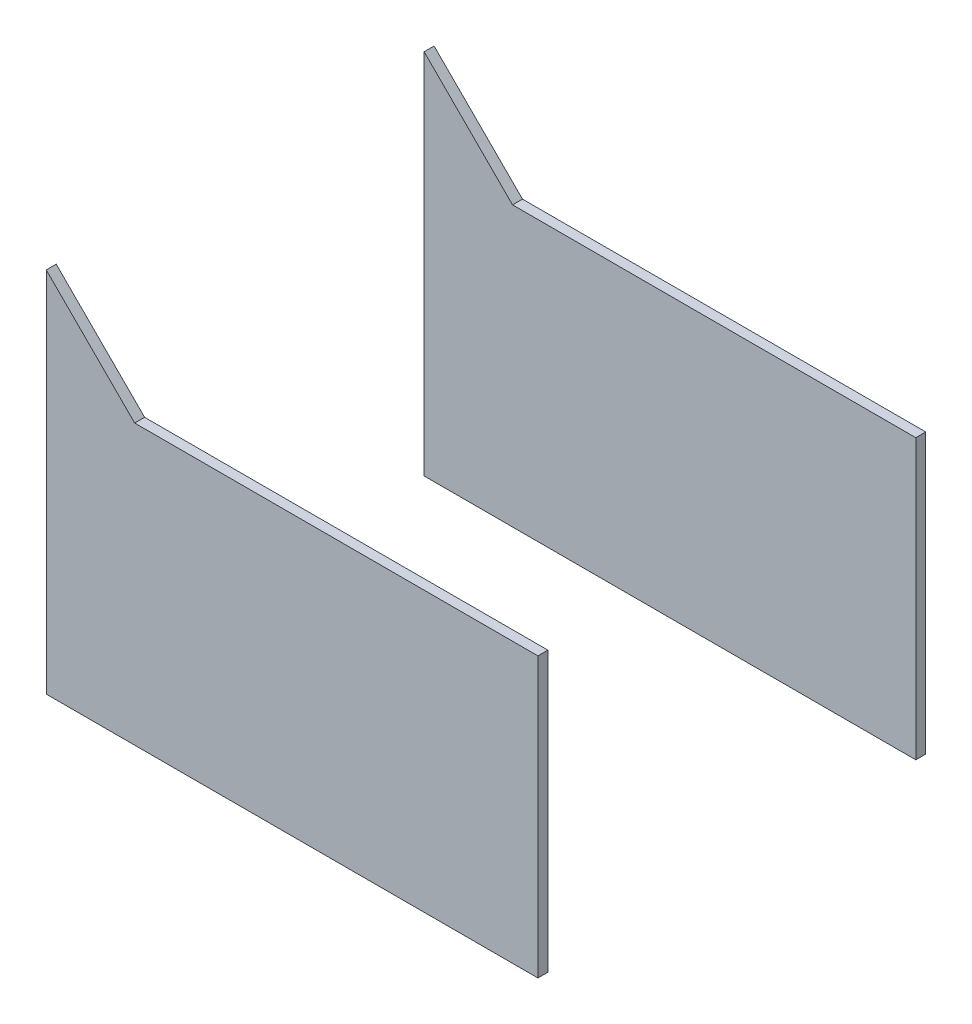
ISO-10303-21;
HEADER;
FILE_DESCRIPTION(('STEP AP214'),'2;1');
FILE_NAME('part.step','',(''),(''),'','','');
FILE_SCHEMA(('AUTOMOTIVE_DESIGN { 1 0 10303 214 1 1 1 1 }'));
ENDSEC;
DATA;
#1=APPLICATION_CONTEXT('core data for automotive mechanical design processes');
#2=APPLICATION_PROTOCOL_DEFINITION('international standard','automotive_design',2000,#1);
#3=PRODUCT_CONTEXT('',#1,'mechanical');
#4=PRODUCT('Part','Part','',(#3));
#5=PRODUCT_RELATED_PRODUCT_CATEGORY('part','',(#4));
#6=PRODUCT_DEFINITION_FORMATION('','',#4);
#7=PRODUCT_DEFINITION_CONTEXT('part definition',#1,'design');
#8=PRODUCT_DEFINITION('design','',#6,#7);
#9=PRODUCT_DEFINITION_SHAPE('','',#8);
#10=(LENGTH_UNIT() NAMED_UNIT(*) SI_UNIT(.MILLI.,.METRE.));
#11=(NAMED_UNIT(*) PLANE_ANGLE_UNIT() SI_UNIT($,.RADIAN.));
#12=(NAMED_UNIT(*) SI_UNIT($,.STERADIAN.) SOLID_ANGLE_UNIT());
#13=UNCERTAINTY_MEASURE_WITH_UNIT(LENGTH_MEASURE(1.E-05),#10,'distance_accuracy_value','');
#14=(GEOMETRIC_REPRESENTATION_CONTEXT(3) GLOBAL_UNCERTAINTY_ASSIGNED_CONTEXT((#13)) GLOBAL_UNIT_ASSIGNED_CONTEXT((#10,
#11,#12)) REPRESENTATION_CONTEXT('',''));
#15=CARTESIAN_POINT('',(0.,0.,0.));
#16=DIRECTION('',(0.,0.,1.));
#17=DIRECTION('',(1.,0.,0.));
#18=AXIS2_PLACEMENT_3D('',#15,#16,#17);
#19=CARTESIAN_POINT('',(-247.202646762909,184.728372850546,-195.));
#20=DIRECTION('',(0.707106781186539,0.707106781186556,0.));
#21=DIRECTION('',(-0.707106781186556,0.707106781186539,0.));
#22=AXIS2_PLACEMENT_3D('',#19,#20,#21);
#23=PLANE('',#22);
#24=DIRECTION('',(-0.707106781186556,0.707106781186539,0.));
#25=VECTOR('',#24,1.);
#26=CARTESIAN_POINT('',(-247.202646762909,184.728372850546,-185.));
#27=LINE('',#26,#25);
#28=CARTESIAN_POINT('',(-158.298623749229,95.824349836869,-185.));
#29=VERTEX_POINT('',#28);
#30=CARTESIAN_POINT('',(-247.202646762909,184.728372850546,-185.));
#31=VERTEX_POINT('',#30);
#32=EDGE_CURVE('E126',#29,#31,#27,.T.);
#33=ORIENTED_EDGE('',*,*,#32,.F.);
#34=DIRECTION('',(0.,0.,1.));
#35=VECTOR('',#34,1.);
#36=CARTESIAN_POINT('',(-158.298623749229,95.824349836869,-195.));
#37=LINE('',#36,#35);
#38=CARTESIAN_POINT('',(-158.298623749229,95.824349836869,-195.));
#39=VERTEX_POINT('',#38);
#40=EDGE_CURVE('E12',#39,#29,#37,.T.);
#41=ORIENTED_EDGE('',*,*,#40,.F.);
#42=DIRECTION('',(-0.707106781186556,0.707106781186539,0.));
#43=VECTOR('',#42,1.);
#44=CARTESIAN_POINT('',(-247.202646762909,184.728372850546,-195.));
#45=LINE('',#44,#43);
#46=CARTESIAN_POINT('',(-247.202646762909,184.728372850546,-195.));
#47=VERTEX_POINT('',#46);
#48=EDGE_CURVE('E121',#39,#47,#45,.T.);
#49=ORIENTED_EDGE('',*,*,#48,.T.);
#50=DIRECTION('',(0.,0.,1.));
#51=VECTOR('',#50,1.);
#52=CARTESIAN_POINT('',(-247.202646762909,184.728372850546,-195.));
#53=LINE('',#52,#51);
#54=EDGE_CURVE('E52',#47,#31,#53,.T.);
#55=ORIENTED_EDGE('',*,*,#54,.T.);
#56=EDGE_LOOP('',(#33,#41,#49,#55));
#57=FACE_BOUND('',#56,.T.);
#58=ADVANCED_FACE('F49',(#57),#23,.T.);
#59=CARTESIAN_POINT('',(-158.298623749229,95.824349836869,-195.));
#60=DIRECTION('',(0.,1.,0.));
#61=DIRECTION('',(0.,0.,1.));
#62=AXIS2_PLACEMENT_3D('',#59,#60,#61);
#63=PLANE('',#62);
#64=DIRECTION('',(-1.,0.,0.));
#65=VECTOR('',#64,1.);
#66=CARTESIAN_POINT('',(-158.298623749229,95.824349836869,-185.));
#67=LINE('',#66,#65);
#68=CARTESIAN_POINT('',(247.202646762909,95.824349836869,-185.));
#69=VERTEX_POINT('',#68);
#70=EDGE_CURVE('E135',#69,#29,#67,.T.);
#71=ORIENTED_EDGE('',*,*,#70,.F.);
#72=DIRECTION('',(0.,0.,1.));
#73=VECTOR('',#72,1.);
#74=CARTESIAN_POINT('',(247.202646762909,95.824349836869,-195.));
#75=LINE('',#74,#73);
#76=CARTESIAN_POINT('',(247.202646762909,95.824349836869,-195.));
#77=VERTEX_POINT('',#76);
#78=EDGE_CURVE('E58',#77,#69,#75,.T.);
#79=ORIENTED_EDGE('',*,*,#78,.F.);
#80=DIRECTION('',(-1.,0.,0.));
#81=VECTOR('',#80,1.);
#82=CARTESIAN_POINT('',(-158.298623749229,95.824349836869,-195.));
#83=LINE('',#82,#81);
#84=EDGE_CURVE('E116',#77,#39,#83,.T.);
#85=ORIENTED_EDGE('',*,*,#84,.T.);
#86=ORIENTED_EDGE('',*,*,#40,.T.);
#87=EDGE_LOOP('',(#71,#79,#85,#86));
#88=FACE_BOUND('',#87,.T.);
#89=ADVANCED_FACE('F141',(#88),#63,.T.);
#90=CARTESIAN_POINT('',(247.202646762909,95.824349836869,-195.));
#91=DIRECTION('',(1.,0.,0.));
#92=DIRECTION('',(0.,0.,-1.));
#93=AXIS2_PLACEMENT_3D('',#90,#91,#92);
#94=PLANE('',#93);
#95=DIRECTION('',(0.,1.,0.));
#96=VECTOR('',#95,1.);
#97=CARTESIAN_POINT('',(247.202646762909,95.824349836869,-185.));
#98=LINE('',#97,#96);
#99=CARTESIAN_POINT('',(247.202646762909,-184.728372850546,-185.));
#100=VERTEX_POINT('',#99);
#101=EDGE_CURVE('E105',#100,#69,#98,.T.);
#102=ORIENTED_EDGE('',*,*,#101,.F.);
#103=DIRECTION('',(0.,0.,1.));
#104=VECTOR('',#103,1.);
#105=CARTESIAN_POINT('',(247.202646762909,-184.728372850546,-195.));
#106=LINE('',#105,#104);
#107=CARTESIAN_POINT('',(247.202646762909,-184.728372850546,-195.));
#108=VERTEX_POINT('',#107);
#109=EDGE_CURVE('E100',#108,#100,#106,.T.);
#110=ORIENTED_EDGE('',*,*,#109,.F.);
#111=DIRECTION('',(0.,1.,0.));
#112=VECTOR('',#111,1.);
#113=CARTESIAN_POINT('',(247.202646762909,95.824349836869,-195.));
#114=LINE('',#113,#112);
#115=EDGE_CURVE('E103',#108,#77,#114,.T.);
#116=ORIENTED_EDGE('',*,*,#115,.T.);
#117=ORIENTED_EDGE('',*,*,#78,.T.);
#118=EDGE_LOOP('',(#102,#110,#116,#117));
#119=FACE_BOUND('',#118,.T.);
#120=ADVANCED_FACE('F102',(#119),#94,.T.);
#121=CARTESIAN_POINT('',(247.202646762909,-184.728372850546,-195.));
#122=DIRECTION('',(0.,-1.,0.));
#123=DIRECTION('',(0.,0.,-1.));
#124=AXIS2_PLACEMENT_3D('',#121,#122,#123);
#125=PLANE('',#124);
#126=DIRECTION('',(1.,0.,0.));
#127=VECTOR('',#126,1.);
#128=CARTESIAN_POINT('',(247.202646762909,-184.728372850546,-185.));
#129=LINE('',#128,#127);
#130=CARTESIAN_POINT('',(-247.202646762909,-184.728372850546,-185.));
#131=VERTEX_POINT('',#130);
#132=EDGE_CURVE('E132',#131,#100,#129,.T.);
#133=ORIENTED_EDGE('',*,*,#132,.F.);
#134=DIRECTION('',(0.,0.,1.));
#135=VECTOR('',#134,1.);
#136=CARTESIAN_POINT('',(-247.202646762909,-184.728372850546,-195.));
#137=LINE('',#136,#135);
#138=CARTESIAN_POINT('',(-247.202646762909,-184.728372850546,-195.));
#139=VERTEX_POINT('',#138);
#140=EDGE_CURVE('E110',#139,#131,#137,.T.);
#141=ORIENTED_EDGE('',*,*,#140,.F.);
#142=DIRECTION('',(1.,0.,0.));
#143=VECTOR('',#142,1.);
#144=CARTESIAN_POINT('',(247.202646762909,-184.728372850546,-195.));
#145=LINE('',#144,#143);
#146=EDGE_CURVE('E115',#139,#108,#145,.T.);
#147=ORIENTED_EDGE('',*,*,#146,.T.);
#148=ORIENTED_EDGE('',*,*,#109,.T.);
#149=EDGE_LOOP('',(#133,#141,#147,#148));
#150=FACE_BOUND('',#149,.T.);
#151=ADVANCED_FACE('F118',(#150),#125,.T.);
#152=CARTESIAN_POINT('',(-247.202646762909,184.728372850546,-195.));
#153=DIRECTION('',(-1.,0.,0.));
#154=DIRECTION('',(0.,0.,1.));
#155=AXIS2_PLACEMENT_3D('',#152,#153,#154);
#156=PLANE('',#155);
#157=DIRECTION('',(0.,-1.,0.));
#158=VECTOR('',#157,1.);
#159=CARTESIAN_POINT('',(-247.202646762909,184.728372850546,-185.));
#160=LINE('',#159,#158);
#161=EDGE_CURVE('E129',#31,#131,#160,.T.);
#162=ORIENTED_EDGE('',*,*,#161,.F.);
#163=ORIENTED_EDGE('',*,*,#54,.F.);
#164=DIRECTION('',(0.,-1.,0.));
#165=VECTOR('',#164,1.);
#166=CARTESIAN_POINT('',(-247.202646762909,184.728372850546,-195.));
#167=LINE('',#166,#165);
#168=EDGE_CURVE('E119',#47,#139,#167,.T.);
#169=ORIENTED_EDGE('',*,*,#168,.T.);
#170=ORIENTED_EDGE('',*,*,#140,.T.);
#171=EDGE_LOOP('',(#162,#163,#169,#170));
#172=FACE_BOUND('',#171,.T.);
#173=ADVANCED_FACE('F138',(#172),#156,.T.);
#174=CARTESIAN_POINT('',(0.,0.,-195.));
#175=DIRECTION('',(0.,0.,1.));
#176=DIRECTION('',(1.,0.,0.));
#177=AXIS2_PLACEMENT_3D('',#174,#175,#176);
#178=PLANE('',#177);
#179=ORIENTED_EDGE('',*,*,#48,.F.);
#180=ORIENTED_EDGE('',*,*,#84,.F.);
#181=ORIENTED_EDGE('',*,*,#115,.F.);
#182=ORIENTED_EDGE('',*,*,#146,.F.);
#183=ORIENTED_EDGE('',*,*,#168,.F.);
#184=EDGE_LOOP('',(#179,#180,#181,#182,#183));
#185=FACE_BOUND('',#184,.T.);
#186=ADVANCED_FACE('F114',(#185),#178,.F.);
#187=CARTESIAN_POINT('',(0.,0.,-185.));
#188=DIRECTION('',(0.,0.,1.));
#189=DIRECTION('',(1.,0.,0.));
#190=AXIS2_PLACEMENT_3D('',#187,#188,#189);
#191=PLANE('',#190);
#192=ORIENTED_EDGE('',*,*,#32,.T.);
#193=ORIENTED_EDGE('',*,*,#161,.T.);
#194=ORIENTED_EDGE('',*,*,#132,.T.);
#195=ORIENTED_EDGE('',*,*,#101,.T.);
#196=ORIENTED_EDGE('',*,*,#70,.T.);
#197=EDGE_LOOP('',(#192,#193,#194,#195,#196));
#198=FACE_BOUND('',#197,.T.);
#199=ADVANCED_FACE('F140',(#198),#191,.T.);
#200=CLOSED_SHELL('',(#58,#89,#120,#151,#173,#186,#199));
#201=MANIFOLD_SOLID_BREP('B2',#200);
#202=CARTESIAN_POINT('',(-247.202646762909,184.728372850546,195.));
#203=DIRECTION('',(0.707106781186539,0.707106781186556,0.));
#204=DIRECTION('',(-0.707106781186556,0.707106781186539,0.));
#205=AXIS2_PLACEMENT_3D('',#202,#203,#204);
#206=PLANE('',#205);
#207=DIRECTION('',(0.707106781186556,-0.707106781186539,0.));
#208=VECTOR('',#207,1.);
#209=CARTESIAN_POINT('',(-247.202646762909,184.728372850546,185.));
#210=LINE('',#209,#208);
#211=CARTESIAN_POINT('',(-247.202646762909,184.728372850546,185.));
#212=VERTEX_POINT('',#211);
#213=CARTESIAN_POINT('',(-158.298623749229,95.824349836869,185.));
#214=VERTEX_POINT('',#213);
#215=EDGE_CURVE('E283',#212,#214,#210,.T.);
#216=ORIENTED_EDGE('',*,*,#215,.F.);
#217=DIRECTION('',(0.,0.,-1.));
#218=VECTOR('',#217,1.);
#219=CARTESIAN_POINT('',(-247.202646762909,184.728372850546,195.));
#220=LINE('',#219,#218);
#221=CARTESIAN_POINT('',(-247.202646762909,184.728372850546,195.));
#222=VERTEX_POINT('',#221);
#223=EDGE_CURVE('E47',#222,#212,#220,.T.);
#224=ORIENTED_EDGE('',*,*,#223,.F.);
#225=DIRECTION('',(0.707106781186556,-0.707106781186539,0.));
#226=VECTOR('',#225,1.);
#227=CARTESIAN_POINT('',(-247.202646762909,184.728372850546,195.));
#228=LINE('',#227,#226);
#229=CARTESIAN_POINT('',(-158.298623749229,95.824349836869,195.));
#230=VERTEX_POINT('',#229);
#231=EDGE_CURVE('E277',#222,#230,#228,.T.);
#232=ORIENTED_EDGE('',*,*,#231,.T.);
#233=DIRECTION('',(0.,0.,-1.));
#234=VECTOR('',#233,1.);
#235=CARTESIAN_POINT('',(-158.298623749229,95.824349836869,195.));
#236=LINE('',#235,#234);
#237=EDGE_CURVE('E202',#230,#214,#236,.T.);
#238=ORIENTED_EDGE('',*,*,#237,.T.);
#239=EDGE_LOOP('',(#216,#224,#232,#238));
#240=FACE_BOUND('',#239,.T.);
#241=ADVANCED_FACE('F199',(#240),#206,.T.);
#242=CARTESIAN_POINT('',(-247.202646762909,184.728372850546,195.));
#243=DIRECTION('',(1.,0.,0.));
#244=DIRECTION('',(0.,0.,-1.));
#245=AXIS2_PLACEMENT_3D('',#242,#243,#244);
#246=PLANE('',#245);
#247=DIRECTION('',(0.,-1.,0.));
#248=VECTOR('',#247,1.);
#249=CARTESIAN_POINT('',(-247.202646762909,184.728372850546,185.));
#250=LINE('',#249,#248);
#251=CARTESIAN_POINT('',(-247.202646762909,-184.728372850546,185.));
#252=VERTEX_POINT('',#251);
#253=EDGE_CURVE('E296',#212,#252,#250,.T.);
#254=ORIENTED_EDGE('',*,*,#253,.T.);
#255=DIRECTION('',(0.,0.,-1.));
#256=VECTOR('',#255,1.);
#257=CARTESIAN_POINT('',(-247.202646762909,-184.728372850546,195.));
#258=LINE('',#257,#256);
#259=CARTESIAN_POINT('',(-247.202646762909,-184.728372850546,195.));
#260=VERTEX_POINT('',#259);
#261=EDGE_CURVE('E209',#260,#252,#258,.T.);
#262=ORIENTED_EDGE('',*,*,#261,.F.);
#263=DIRECTION('',(0.,-1.,0.));
#264=VECTOR('',#263,1.);
#265=CARTESIAN_POINT('',(-247.202646762909,184.728372850546,195.));
#266=LINE('',#265,#264);
#267=EDGE_CURVE('E269',#222,#260,#266,.T.);
#268=ORIENTED_EDGE('',*,*,#267,.F.);
#269=ORIENTED_EDGE('',*,*,#223,.T.);
#270=EDGE_LOOP('',(#254,#262,#268,#269));
#271=FACE_BOUND('',#270,.T.);
#272=ADVANCED_FACE('F305',(#271),#246,.F.);
#273=CARTESIAN_POINT('',(247.202646762909,-184.728372850546,195.));
#274=DIRECTION('',(0.,-1.,0.));
#275=DIRECTION('',(0.,0.,-1.));
#276=AXIS2_PLACEMENT_3D('',#273,#274,#275);
#277=PLANE('',#276);
#278=DIRECTION('',(-1.,0.,0.));
#279=VECTOR('',#278,1.);
#280=CARTESIAN_POINT('',(247.202646762909,-184.728372850546,185.));
#281=LINE('',#280,#279);
#282=CARTESIAN_POINT('',(247.202646762909,-184.728372850546,185.));
#283=VERTEX_POINT('',#282);
#284=EDGE_CURVE('E256',#283,#252,#281,.T.);
#285=ORIENTED_EDGE('',*,*,#284,.F.);
#286=DIRECTION('',(0.,0.,-1.));
#287=VECTOR('',#286,1.);
#288=CARTESIAN_POINT('',(247.202646762909,-184.728372850546,195.));
#289=LINE('',#288,#287);
#290=CARTESIAN_POINT('',(247.202646762909,-184.728372850546,195.));
#291=VERTEX_POINT('',#290);
#292=EDGE_CURVE('E251',#291,#283,#289,.T.);
#293=ORIENTED_EDGE('',*,*,#292,.F.);
#294=DIRECTION('',(-1.,0.,0.));
#295=VECTOR('',#294,1.);
#296=CARTESIAN_POINT('',(247.202646762909,-184.728372850546,195.));
#297=LINE('',#296,#295);
#298=EDGE_CURVE('E254',#291,#260,#297,.T.);
#299=ORIENTED_EDGE('',*,*,#298,.T.);
#300=ORIENTED_EDGE('',*,*,#261,.T.);
#301=EDGE_LOOP('',(#285,#293,#299,#300));
#302=FACE_BOUND('',#301,.T.);
#303=ADVANCED_FACE('F253',(#302),#277,.T.);
#304=CARTESIAN_POINT('',(247.202646762909,95.824349836869,195.));
#305=DIRECTION('',(1.,0.,0.));
#306=DIRECTION('',(0.,0.,-1.));
#307=AXIS2_PLACEMENT_3D('',#304,#305,#306);
#308=PLANE('',#307);
#309=DIRECTION('',(0.,-1.,0.));
#310=VECTOR('',#309,1.);
#311=CARTESIAN_POINT('',(247.202646762909,95.824349836869,185.));
#312=LINE('',#311,#310);
#313=CARTESIAN_POINT('',(247.202646762909,95.824349836869,185.));
#314=VERTEX_POINT('',#313);
#315=EDGE_CURVE('E291',#314,#283,#312,.T.);
#316=ORIENTED_EDGE('',*,*,#315,.F.);
#317=DIRECTION('',(0.,0.,-1.));
#318=VECTOR('',#317,1.);
#319=CARTESIAN_POINT('',(247.202646762909,95.824349836869,195.));
#320=LINE('',#319,#318);
#321=CARTESIAN_POINT('',(247.202646762909,95.824349836869,195.));
#322=VERTEX_POINT('',#321);
#323=EDGE_CURVE('E262',#322,#314,#320,.T.);
#324=ORIENTED_EDGE('',*,*,#323,.F.);
#325=DIRECTION('',(0.,-1.,0.));
#326=VECTOR('',#325,1.);
#327=CARTESIAN_POINT('',(247.202646762909,95.824349836869,195.));
#328=LINE('',#327,#326);
#329=EDGE_CURVE('E268',#322,#291,#328,.T.);
#330=ORIENTED_EDGE('',*,*,#329,.T.);
#331=ORIENTED_EDGE('',*,*,#292,.T.);
#332=EDGE_LOOP('',(#316,#324,#330,#331));
#333=FACE_BOUND('',#332,.T.);
#334=ADVANCED_FACE('F272',(#333),#308,.T.);
#335=CARTESIAN_POINT('',(-158.298623749229,95.824349836869,195.));
#336=DIRECTION('',(0.,1.,0.));
#337=DIRECTION('',(0.,0.,1.));
#338=AXIS2_PLACEMENT_3D('',#335,#336,#337);
#339=PLANE('',#338);
#340=DIRECTION('',(1.,0.,0.));
#341=VECTOR('',#340,1.);
#342=CARTESIAN_POINT('',(-158.298623749229,95.824349836869,185.));
#343=LINE('',#342,#341);
#344=EDGE_CURVE('E287',#214,#314,#343,.T.);
#345=ORIENTED_EDGE('',*,*,#344,.F.);
#346=ORIENTED_EDGE('',*,*,#237,.F.);
#347=DIRECTION('',(1.,0.,0.));
#348=VECTOR('',#347,1.);
#349=CARTESIAN_POINT('',(-158.298623749229,95.824349836869,195.));
#350=LINE('',#349,#348);
#351=EDGE_CURVE('E274',#230,#322,#350,.T.);
#352=ORIENTED_EDGE('',*,*,#351,.T.);
#353=ORIENTED_EDGE('',*,*,#323,.T.);
#354=EDGE_LOOP('',(#345,#346,#352,#353));
#355=FACE_BOUND('',#354,.T.);
#356=ADVANCED_FACE('F302',(#355),#339,.T.);
#357=CARTESIAN_POINT('',(0.,0.,195.));
#358=DIRECTION('',(0.,0.,1.));
#359=DIRECTION('',(1.,0.,0.));
#360=AXIS2_PLACEMENT_3D('',#357,#358,#359);
#361=PLANE('',#360);
#362=ORIENTED_EDGE('',*,*,#231,.F.);
#363=ORIENTED_EDGE('',*,*,#267,.T.);
#364=ORIENTED_EDGE('',*,*,#298,.F.);
#365=ORIENTED_EDGE('',*,*,#329,.F.);
#366=ORIENTED_EDGE('',*,*,#351,.F.);
#367=EDGE_LOOP('',(#362,#363,#364,#365,#366));
#368=FACE_BOUND('',#367,.T.);
#369=ADVANCED_FACE('F267',(#368),#361,.T.);
#370=CARTESIAN_POINT('',(0.,0.,185.));
#371=DIRECTION('',(0.,0.,1.));
#372=DIRECTION('',(1.,0.,0.));
#373=AXIS2_PLACEMENT_3D('',#370,#371,#372);
#374=PLANE('',#373);
#375=ORIENTED_EDGE('',*,*,#215,.T.);
#376=ORIENTED_EDGE('',*,*,#344,.T.);
#377=ORIENTED_EDGE('',*,*,#315,.T.);
#378=ORIENTED_EDGE('',*,*,#284,.T.);
#379=ORIENTED_EDGE('',*,*,#253,.F.);
#380=EDGE_LOOP('',(#375,#376,#377,#378,#379));
#381=FACE_BOUND('',#380,.T.);
#382=ADVANCED_FACE('F304',(#381),#374,.F.);
#383=CLOSED_SHELL('',(#241,#272,#303,#334,#356,#369,#382));
#384=MANIFOLD_SOLID_BREP('B6',#383);
#385=ADVANCED_BREP_SHAPE_REPRESENTATION('',(#18,#201,#384),#14);
#386=SHAPE_DEFINITION_REPRESENTATION(#9,#385);
ENDSEC;
END-ISO-10303-21;
